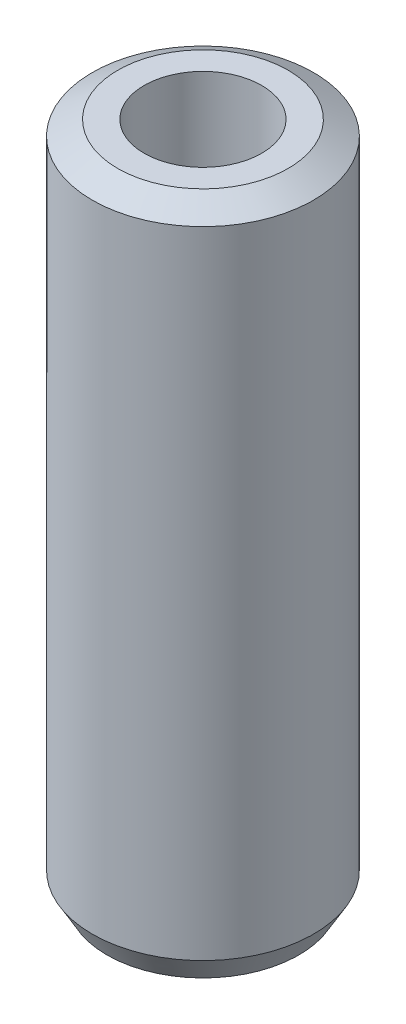
ISO-10303-21;
HEADER;
FILE_DESCRIPTION(('STEP AP214'),'2;1');
FILE_NAME('part.step','',(''),(''),'','','');
FILE_SCHEMA(('AUTOMOTIVE_DESIGN { 1 0 10303 214 1 1 1 1 }'));
ENDSEC;
DATA;
#1=APPLICATION_CONTEXT('core data for automotive mechanical design processes');
#2=APPLICATION_PROTOCOL_DEFINITION('international standard','automotive_design',2000,#1);
#3=PRODUCT_CONTEXT('',#1,'mechanical');
#4=PRODUCT('Part','Part','',(#3));
#5=PRODUCT_RELATED_PRODUCT_CATEGORY('part','',(#4));
#6=PRODUCT_DEFINITION_FORMATION('','',#4);
#7=PRODUCT_DEFINITION_CONTEXT('part definition',#1,'design');
#8=PRODUCT_DEFINITION('design','',#6,#7);
#9=PRODUCT_DEFINITION_SHAPE('','',#8);
#10=(LENGTH_UNIT() NAMED_UNIT(*) SI_UNIT(.MILLI.,.METRE.));
#11=(NAMED_UNIT(*) PLANE_ANGLE_UNIT() SI_UNIT($,.RADIAN.));
#12=(NAMED_UNIT(*) SI_UNIT($,.STERADIAN.) SOLID_ANGLE_UNIT());
#13=UNCERTAINTY_MEASURE_WITH_UNIT(LENGTH_MEASURE(1.E-05),#10,'distance_accuracy_value','');
#14=(GEOMETRIC_REPRESENTATION_CONTEXT(3) GLOBAL_UNCERTAINTY_ASSIGNED_CONTEXT((#13)) GLOBAL_UNIT_ASSIGNED_CONTEXT((#10,
#11,#12)) REPRESENTATION_CONTEXT('',''));
#15=CARTESIAN_POINT('',(0.,0.,0.));
#16=DIRECTION('',(0.,0.,1.));
#17=DIRECTION('',(1.,0.,0.));
#18=AXIS2_PLACEMENT_3D('',#15,#16,#17);
#19=CARTESIAN_POINT('',(0.,183.25062348875,0.));
#20=DIRECTION('',(0.,-1.,0.));
#21=DIRECTION('',(0.,0.,-1.));
#22=AXIS2_PLACEMENT_3D('',#19,#20,#21);
#23=CYLINDRICAL_SURFACE('',#22,30.);
#24=CARTESIAN_POINT('',(0.,179.266282141505,0.));
#25=DIRECTION('',(0.,1.,0.));
#26=DIRECTION('',(0.,0.,1.));
#27=AXIS2_PLACEMENT_3D('',#24,#25,#26);
#28=CIRCLE('',#27,30.);
#29=CARTESIAN_POINT('',(0.,179.266282141505,30.));
#30=VERTEX_POINT('',#29);
#31=EDGE_CURVE('E50',#30,#30,#28,.F.);
#32=ORIENTED_EDGE('',*,*,#31,.T.);
#33=EDGE_LOOP('',(#32));
#34=FACE_BOUND('',#33,.T.);
#35=CARTESIAN_POINT('',(0.,6.90108164812661,0.));
#36=DIRECTION('',(0.,1.,0.));
#37=DIRECTION('',(0.,0.,1.));
#38=AXIS2_PLACEMENT_3D('',#35,#36,#37);
#39=CIRCLE('',#38,30.);
#40=CARTESIAN_POINT('',(0.,6.90108164812661,30.));
#41=VERTEX_POINT('',#40);
#42=EDGE_CURVE('E51',#41,#41,#39,.T.);
#43=ORIENTED_EDGE('',*,*,#42,.T.);
#44=EDGE_LOOP('',(#43));
#45=FACE_BOUND('',#44,.T.);
#46=ADVANCED_FACE('F39',(#34,#45),#23,.T.);
#47=CARTESIAN_POINT('',(0.,183.25062348875,0.));
#48=DIRECTION('',(0.,1.,0.));
#49=DIRECTION('',(0.,0.,1.));
#50=AXIS2_PLACEMENT_3D('',#47,#48,#49);
#51=PLANE('',#50);
#52=CARTESIAN_POINT('',(0.,183.25062348875,0.));
#53=DIRECTION('',(0.,1.,0.));
#54=DIRECTION('',(0.,0.,1.));
#55=AXIS2_PLACEMENT_3D('',#52,#53,#54);
#56=CIRCLE('',#55,23.0989183518735);
#57=CARTESIAN_POINT('',(0.,183.25062348875,23.0989183518735));
#58=VERTEX_POINT('',#57);
#59=EDGE_CURVE('E54',#58,#58,#56,.T.);
#60=ORIENTED_EDGE('',*,*,#59,.T.);
#61=EDGE_LOOP('',(#60));
#62=FACE_BOUND('',#61,.T.);
#63=CARTESIAN_POINT('',(0.,183.25062348875,0.));
#64=DIRECTION('',(0.,1.,0.));
#65=DIRECTION('',(0.,0.,1.));
#66=AXIS2_PLACEMENT_3D('',#63,#64,#65);
#67=CIRCLE('',#66,15.9460423134977);
#68=CARTESIAN_POINT('',(0.,183.25062348875,15.9460423134977));
#69=VERTEX_POINT('',#68);
#70=EDGE_CURVE('E58',#69,#69,#67,.T.);
#71=ORIENTED_EDGE('',*,*,#70,.F.);
#72=EDGE_LOOP('',(#71));
#73=FACE_BOUND('',#72,.T.);
#74=ADVANCED_FACE('F69',(#62,#73),#51,.T.);
#75=CARTESIAN_POINT('',(0.,0.,0.));
#76=DIRECTION('',(0.,1.,0.));
#77=DIRECTION('',(0.,0.,1.));
#78=AXIS2_PLACEMENT_3D('',#75,#76,#77);
#79=PLANE('',#78);
#80=CARTESIAN_POINT('',(0.,0.,0.));
#81=DIRECTION('',(0.,1.,0.));
#82=DIRECTION('',(0.,0.,1.));
#83=AXIS2_PLACEMENT_3D('',#80,#81,#82);
#84=CIRCLE('',#83,26.0156586527545);
#85=CARTESIAN_POINT('',(0.,0.,26.0156586527545));
#86=VERTEX_POINT('',#85);
#87=EDGE_CURVE('E10',#86,#86,#84,.F.);
#88=ORIENTED_EDGE('',*,*,#87,.T.);
#89=EDGE_LOOP('',(#88));
#90=FACE_BOUND('',#89,.T.);
#91=CARTESIAN_POINT('',(0.,0.,0.));
#92=DIRECTION('',(0.,1.,0.));
#93=DIRECTION('',(0.,0.,1.));
#94=AXIS2_PLACEMENT_3D('',#91,#92,#93);
#95=CIRCLE('',#94,15.9460423134977);
#96=CARTESIAN_POINT('',(0.,0.,15.9460423134977));
#97=VERTEX_POINT('',#96);
#98=EDGE_CURVE('E63',#97,#97,#95,.T.);
#99=ORIENTED_EDGE('',*,*,#98,.T.);
#100=EDGE_LOOP('',(#99));
#101=FACE_BOUND('',#100,.T.);
#102=ADVANCED_FACE('F75',(#90,#101),#79,.F.);
#103=CARTESIAN_POINT('',(0.,183.25062348875,0.));
#104=DIRECTION('',(0.,-1.,0.));
#105=DIRECTION('',(0.,0.,-1.));
#106=AXIS2_PLACEMENT_3D('',#103,#104,#105);
#107=CYLINDRICAL_SURFACE('',#106,15.9460423134977);
#108=ORIENTED_EDGE('',*,*,#70,.T.);
#109=EDGE_LOOP('',(#108));
#110=FACE_BOUND('',#109,.T.);
#111=ORIENTED_EDGE('',*,*,#98,.F.);
#112=EDGE_LOOP('',(#111));
#113=FACE_BOUND('',#112,.T.);
#114=ADVANCED_FACE('F70',(#110,#113),#107,.F.);
#115=CARTESIAN_POINT('',(0.,183.25062348875,0.));
#116=DIRECTION('',(0.,-1.,0.));
#117=DIRECTION('',(0.,0.,-1.));
#118=AXIS2_PLACEMENT_3D('',#115,#116,#117);
#119=CONICAL_SURFACE('',#118,23.0989183518735,1.0471975511966);
#120=ORIENTED_EDGE('',*,*,#31,.F.);
#121=EDGE_LOOP('',(#120));
#122=FACE_BOUND('',#121,.T.);
#123=ORIENTED_EDGE('',*,*,#59,.F.);
#124=EDGE_LOOP('',(#123));
#125=FACE_BOUND('',#124,.T.);
#126=ADVANCED_FACE('F81',(#122,#125),#119,.T.);
#127=CARTESIAN_POINT('',(0.,6.90108164812661,0.));
#128=DIRECTION('',(0.,1.,0.));
#129=DIRECTION('',(0.,0.,1.));
#130=AXIS2_PLACEMENT_3D('',#127,#128,#129);
#131=CONICAL_SURFACE('',#130,30.,0.523598775598305);
#132=ORIENTED_EDGE('',*,*,#87,.F.);
#133=EDGE_LOOP('',(#132));
#134=FACE_BOUND('',#133,.T.);
#135=ORIENTED_EDGE('',*,*,#42,.F.);
#136=EDGE_LOOP('',(#135));
#137=FACE_BOUND('',#136,.T.);
#138=ADVANCED_FACE('F45',(#134,#137),#131,.T.);
#139=CLOSED_SHELL('',(#46,#74,#102,#114,#126,#138));
#140=MANIFOLD_SOLID_BREP('B2',#139);
#141=ADVANCED_BREP_SHAPE_REPRESENTATION('',(#18,#140),#14);
#142=SHAPE_DEFINITION_REPRESENTATION(#9,#141);
ENDSEC;
END-ISO-10303-21;
